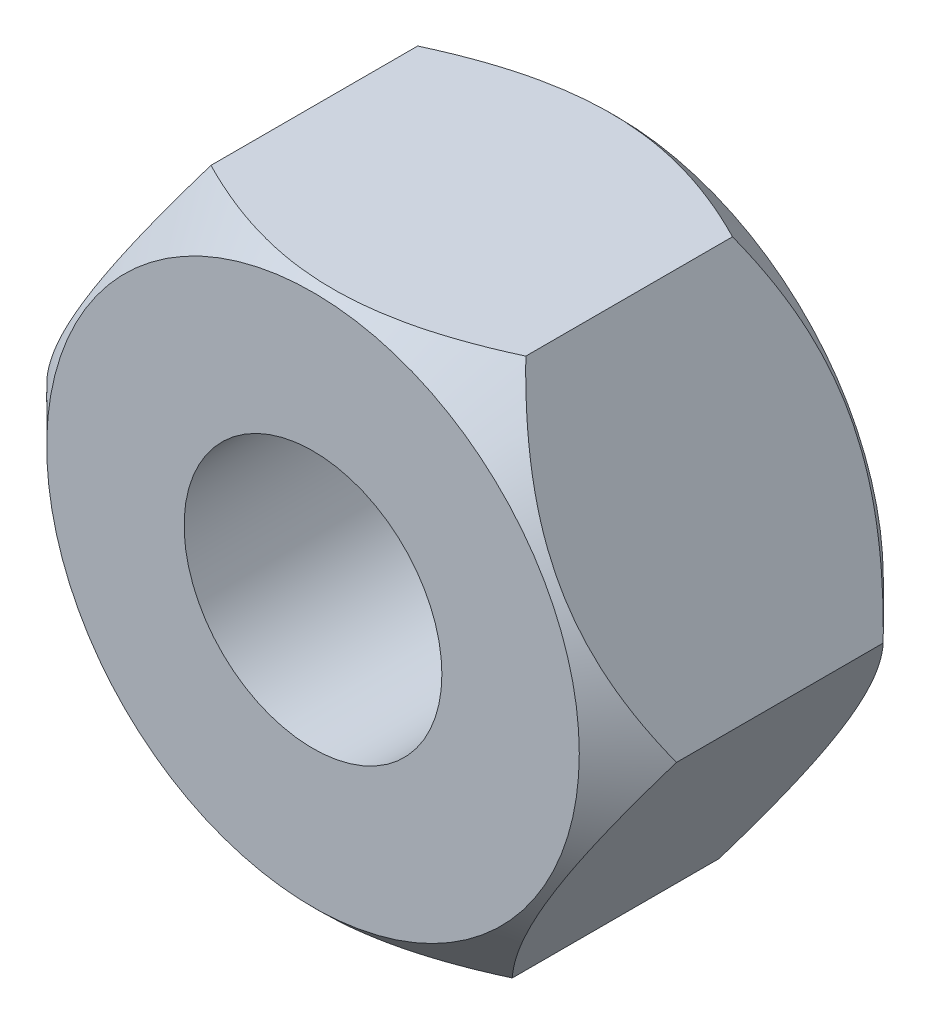
ISO-10303-21;
HEADER;
FILE_DESCRIPTION(('STEP AP214'),'2;1');
FILE_NAME('part.step','',(''),(''),'','','');
FILE_SCHEMA(('AUTOMOTIVE_DESIGN { 1 0 10303 214 1 1 1 1 }'));
ENDSEC;
DATA;
#1=APPLICATION_CONTEXT('core data for automotive mechanical design processes');
#2=APPLICATION_PROTOCOL_DEFINITION('international standard','automotive_design',2000,#1);
#3=PRODUCT_CONTEXT('',#1,'mechanical');
#4=PRODUCT('Part','Part','',(#3));
#5=PRODUCT_RELATED_PRODUCT_CATEGORY('part','',(#4));
#6=PRODUCT_DEFINITION_FORMATION('','',#4);
#7=PRODUCT_DEFINITION_CONTEXT('part definition',#1,'design');
#8=PRODUCT_DEFINITION('design','',#6,#7);
#9=PRODUCT_DEFINITION_SHAPE('','',#8);
#10=(LENGTH_UNIT() NAMED_UNIT(*) SI_UNIT(.MILLI.,.METRE.));
#11=(NAMED_UNIT(*) PLANE_ANGLE_UNIT() SI_UNIT($,.RADIAN.));
#12=(NAMED_UNIT(*) SI_UNIT($,.STERADIAN.) SOLID_ANGLE_UNIT());
#13=UNCERTAINTY_MEASURE_WITH_UNIT(LENGTH_MEASURE(1.E-05),#10,'distance_accuracy_value','');
#14=(GEOMETRIC_REPRESENTATION_CONTEXT(3) GLOBAL_UNCERTAINTY_ASSIGNED_CONTEXT((#13)) GLOBAL_UNIT_ASSIGNED_CONTEXT((#10,
#11,#12)) REPRESENTATION_CONTEXT('',''));
#15=CARTESIAN_POINT('',(0.,0.,0.));
#16=DIRECTION('',(0.,0.,1.));
#17=DIRECTION('',(1.,0.,0.));
#18=AXIS2_PLACEMENT_3D('',#15,#16,#17);
#19=CARTESIAN_POINT('',(0.,0.,0.599999999999999));
#20=DIRECTION('',(0.,0.,1.));
#21=DIRECTION('',(1.,0.,0.));
#22=AXIS2_PLACEMENT_3D('',#19,#20,#21);
#23=CONICAL_SURFACE('',#22,3.885,0.78539816339745);
#24=CARTESIAN_POINT('',(0.,0.,0.));
#25=DIRECTION('',(0.,0.,1.));
#26=DIRECTION('',(1.,0.,0.));
#27=AXIS2_PLACEMENT_3D('',#24,#25,#26);
#28=CIRCLE('',#27,3.285);
#29=CARTESIAN_POINT('',(3.285,0.,0.));
#30=VERTEX_POINT('',#29);
#31=EDGE_CURVE('E256',#30,#30,#28,.F.);
#32=ORIENTED_EDGE('',*,*,#31,.F.);
#33=EDGE_LOOP('',(#32));
#34=FACE_BOUND('',#33,.T.);
#35=CARTESIAN_POINT('',(-3.88393621874266,0.0957860703586579,0.600117182600256));
#36=CARTESIAN_POINT('',(-3.81432747230008,0.209753081961758,0.533403534923081));
#37=CARTESIAN_POINT('',(-3.74355478482969,0.32562575754246,0.470608192342962));
#38=CARTESIAN_POINT('',(-3.59924158049262,0.561902741020839,0.355631616504008));
#39=CARTESIAN_POINT('',(-3.52568734046069,0.682329517188863,0.303514352330282));
#40=CARTESIAN_POINT('',(-3.37736875756146,0.925164311982584,0.21423656712047));
#41=CARTESIAN_POINT('',(-3.3026421836569,1.04751049332441,0.176851660514754));
#42=CARTESIAN_POINT('',(-3.15154397343851,1.29489623659983,0.119252598754752));
#43=CARTESIAN_POINT('',(-3.07517695250471,1.4199282419964,0.0989954503753128));
#44=CARTESIAN_POINT('',(-2.94356112301121,1.6354164318234,0.080718082682288));
#45=CARTESIAN_POINT('',(-2.88848227797078,1.7255943432585,0.0780125494006204));
#46=CARTESIAN_POINT('',(-2.77841418286368,1.90580347664019,0.0825717961445522));
#47=CARTESIAN_POINT('',(-2.72342497097033,1.99583463608743,0.0898400713960599));
#48=CARTESIAN_POINT('',(-2.61396751308934,2.17504400286808,0.113931928536201));
#49=CARTESIAN_POINT('',(-2.55949991922261,2.26422114251567,0.130766198224998));
#50=CARTESIAN_POINT('',(-2.45150019324659,2.44104383581893,0.173071204872371));
#51=CARTESIAN_POINT('',(-2.39796798974781,2.52868950635715,0.198541279687599));
#52=CARTESIAN_POINT('',(-2.30293338267659,2.68428504169289,0.250944528651334));
#53=CARTESIAN_POINT('',(-2.2612206136008,2.75257932768724,0.276500136451541));
#54=CARTESIAN_POINT('',(-2.17854393261304,2.88794183230023,0.33173002019738));
#55=CARTESIAN_POINT('',(-2.13758004356713,2.95501001348138,0.361404421667987));
#56=CARTESIAN_POINT('',(-2.05653017850464,3.08770901158252,0.42420661778084));
#57=CARTESIAN_POINT('',(-2.01644189724197,3.15334360276971,0.457323553257847));
#58=CARTESIAN_POINT('',(-1.93700776123357,3.28339724635341,0.526575899032486));
#59=CARTESIAN_POINT('',(-1.89766146881812,3.34781701532526,0.56270945703257));
#60=CARTESIAN_POINT('',(-1.85865850009685,3.41167467712757,0.600117182600256));
#61=B_SPLINE_CURVE_WITH_KNOTS('',3,(#35,#36,#37,#38,#39,#40,#41,#42,#43,#44,#45,#46,#47,#48,#49,
#50,#51,#52,#53,#54,#55,#56,#57,#58,#59,#60),.UNSPECIFIED.,.F.,.F.,(4,2,2,2,2,2,2,2,2,2,2,2,4),
(0.,0.448150707406919,0.898912335595667,1.34251535645382,1.78500153365474,2.1016612602705,
2.41843198560602,2.73555732725301,3.05265835906844,3.30456080407632,3.55647092778736,
3.80760924167498,4.05859446750521),.UNSPECIFIED.);
#62=CARTESIAN_POINT('',(-3.88381406278636,0.0959860703586579,0.599999999999999));
#63=VERTEX_POINT('',#62);
#64=CARTESIAN_POINT('',(-1.85878065605314,3.41147467712757,0.599999999999999));
#65=VERTEX_POINT('',#64);
#66=EDGE_CURVE('E149',#63,#65,#61,.T.);
#67=ORIENTED_EDGE('',*,*,#66,.T.);
#68=CARTESIAN_POINT('',(-1.85898065605314,3.41147962000428,0.600100034398637));
#69=CARTESIAN_POINT('',(-1.72548002243513,3.40818023414176,0.533388295583328));
#70=CARTESIAN_POINT('',(-1.58974712034719,3.40482567914012,0.470594830359262));
#71=CARTESIAN_POINT('',(-1.3129730969512,3.39798537977108,0.355621835959947));
#72=CARTESIAN_POINT('',(-1.17190565820719,3.39449898498448,0.303506271380686));
#73=CARTESIAN_POINT('',(-0.887449983627508,3.38746883834185,0.214231478416903));
#74=CARTESIAN_POINT('',(-0.744134178883922,3.38392687657559,0.176847879293125));
#75=CARTESIAN_POINT('',(-0.454347655622486,3.37676498129402,0.119250908599851));
#76=CARTESIAN_POINT('',(-0.307885788030815,3.37314526652389,0.0989945473738914));
#77=CARTESIAN_POINT('',(-0.0554622919437957,3.36690677542625,0.0807178344892078));
#78=CARTESIAN_POINT('',(0.0501733937198126,3.3642960545749,0.0780124943011009));
#79=CARTESIAN_POINT('',(0.261272912154858,3.35907886011048,0.0825721053586667));
#80=CARTESIAN_POINT('',(0.366736671709077,3.35647238830694,0.0898405517431846));
#81=CARTESIAN_POINT('',(0.576665010368219,3.3512841388287,0.11393271862506));
#82=CARTESIAN_POINT('',(0.681128338833483,3.3487023920628,0.130767126227319));
#83=CARTESIAN_POINT('',(0.888260867781066,3.34358323929809,0.173072372500431));
#84=CARTESIAN_POINT('',(0.990930205187871,3.34104582991528,0.198542549000921));
#85=CARTESIAN_POINT('',(1.17319356216092,3.33654130340516,0.250944977705818));
#86=CARTESIAN_POINT('',(1.25319109996945,3.33456421357323,0.276499472781657));
#87=CARTESIAN_POINT('',(1.41175006327297,3.33064552653992,0.331726790229512));
#88=CARTESIAN_POINT('',(1.49031144498599,3.32870393042057,0.361399737918555));
#89=CARTESIAN_POINT('',(1.64575058409665,3.32486234791895,0.424198760056415));
#90=CARTESIAN_POINT('',(1.72263276247261,3.32296225227492,0.457313975869242));
#91=CARTESIAN_POINT('',(1.87497334035334,3.31919724880396,0.526562676771717));
#92=CARTESIAN_POINT('',(1.95043257903981,3.31733232023717,0.562694310040499));
#93=CARTESIAN_POINT('',(2.02523340673322,3.3154836638922,0.600100034398637));
#94=B_SPLINE_CURVE_WITH_KNOTS('',3,(#68,#69,#70,#71,#72,#73,#74,#75,#76,#77,#78,#79,#80,#81,#82,
#83,#84,#85,#86,#87,#88,#89,#90,#91,#92,#93),.UNSPECIFIED.,.F.,.F.,(4,2,2,2,2,2,2,2,2,2,2,2,4),
(0.,0.448142581482843,0.898895901479806,1.3424910441838,1.78496942204691,2.10162883673493,
2.41839924751297,2.73552425237839,3.05262494634458,3.30451657794585,3.5564158758327,
3.80754337623053,4.05851782396052),.UNSPECIFIED.);
#95=CARTESIAN_POINT('',(2.02503340673322,3.31548860676891,0.599999999999999));
#96=VERTEX_POINT('',#95);
#97=EDGE_CURVE('E133',#65,#96,#94,.T.);
#98=ORIENTED_EDGE('',*,*,#97,.T.);
#99=CARTESIAN_POINT('',(2.02492443446568,3.31568860676891,0.600113885377533));
#100=CARTESIAN_POINT('',(2.08881819828606,3.19842250730216,0.53340060473433));
#101=CARTESIAN_POINT('',(2.15378033990459,3.07919558271485,0.470605623130255));
#102=CARTESIAN_POINT('',(2.28624519836053,2.83607894129721,0.355629735926545));
#103=CARTESIAN_POINT('',(2.35376051150211,2.71216610610024,0.303512798548834));
#104=CARTESIAN_POINT('',(2.48990188708813,2.46230184491991,0.214235588683634));
#105=CARTESIAN_POINT('',(2.55849328191177,2.33641404543818,0.176850933478149));
#106=CARTESIAN_POINT('',(2.6971860622483,2.08186711625766,0.119252273783184));
#107=CARTESIAN_POINT('',(2.76728321138255,1.95321576170888,0.0989952767547544));
#108=CARTESIAN_POINT('',(2.88809329797167,1.73148946506476,0.0807180349625505));
#109=CARTESIAN_POINT('',(2.9386502285016,1.63870084705624,0.0780125388061672));
#110=CARTESIAN_POINT('',(3.03968184851493,1.45327455044493,0.0825718555946414));
#111=CARTESIAN_POINT('',(3.09015650295858,1.36063693615164,0.0898401637486656));
#112=CARTESIAN_POINT('',(3.19062761482422,1.17623935658986,0.113932080440056));
#113=CARTESIAN_POINT('',(3.24062347366949,1.08448048990676,0.130766376643903));
#114=CARTESIAN_POINT('',(3.33975652942678,0.902538683980961,0.17307142936074));
#115=CARTESIAN_POINT('',(3.38889379186789,0.812355624470771,0.198541523725189));
#116=CARTESIAN_POINT('',(3.47612584034231,0.652256086402455,0.250944614970376));
#117=CARTESIAN_POINT('',(3.51441372646593,0.581985205582748,0.276500008819832));
#118=CARTESIAN_POINT('',(3.59030213300601,0.44270498639391,0.331729399126499));
#119=CARTESIAN_POINT('',(3.6279026324404,0.373695686533798,0.361403521068699));
#120=CARTESIAN_POINT('',(3.70229780546919,0.23715604262167,0.424205106899933));
#121=CARTESIAN_POINT('',(3.73909459502827,0.169621815077606,0.457321711725485));
#122=CARTESIAN_POINT('',(3.81200671114683,0.0358040690276733,0.526573356676187));
#123=CARTESIAN_POINT('',(3.84812243942313,-0.0304801867608648,0.562706544595449));
#124=CARTESIAN_POINT('',(3.8839230350539,-0.0961860703586588,0.600113885377532));
#125=B_SPLINE_CURVE_WITH_KNOTS('',3,(#99,#100,#101,#102,#103,#104,#105,#106,#107,#108,#109,#110,
#111,#112,#113,#114,#115,#116,#117,#118,#119,#120,#121,#122,#123,#124),.UNSPECIFIED.,.F.,.F.,(4,
2,2,2,2,2,2,2,2,2,2,2,4),(0.,0.448149144958839,0.898909175652596,1.34251068170457,
1.78499535925434,2.10165502588874,2.41842569073722,2.73555096762401,3.05265193447399,
3.30455230033247,3.55646034250635,3.80759657722808,4.05857973069729),.UNSPECIFIED.);
#126=CARTESIAN_POINT('',(3.88381406278636,-0.0959860703586585,0.599999999999999));
#127=VERTEX_POINT('',#126);
#128=EDGE_CURVE('E199',#96,#127,#125,.T.);
#129=ORIENTED_EDGE('',*,*,#128,.T.);
#130=CARTESIAN_POINT('',(3.88393621874266,-0.0957860703586585,0.600117182600255));
#131=CARTESIAN_POINT('',(3.81432747230008,-0.209753081961759,0.53340353492308));
#132=CARTESIAN_POINT('',(3.74355478482969,-0.325625757542461,0.470608192342961));
#133=CARTESIAN_POINT('',(3.59924158049262,-0.561902741020839,0.355631616504008));
#134=CARTESIAN_POINT('',(3.52568734046069,-0.682329517188863,0.303514352330281));
#135=CARTESIAN_POINT('',(3.37736875756146,-0.925164311982584,0.214236567120469));
#136=CARTESIAN_POINT('',(3.3026421836569,-1.04751049332441,0.176851660514753));
#137=CARTESIAN_POINT('',(3.15154397343851,-1.29489623659983,0.11925259875475));
#138=CARTESIAN_POINT('',(3.07517695250471,-1.4199282419964,0.0989954503753113));
#139=CARTESIAN_POINT('',(2.94356112301121,-1.6354164318234,0.0807180826822865));
#140=CARTESIAN_POINT('',(2.88848227797078,-1.7255943432585,0.0780125494006191));
#141=CARTESIAN_POINT('',(2.77841418286368,-1.90580347664019,0.082571796144551));
#142=CARTESIAN_POINT('',(2.72342497097033,-1.99583463608743,0.0898400713960587));
#143=CARTESIAN_POINT('',(2.61396751308934,-2.17504400286808,0.1139319285362));
#144=CARTESIAN_POINT('',(2.55949991922261,-2.26422114251566,0.130766198224996));
#145=CARTESIAN_POINT('',(2.45150019324659,-2.44104383581893,0.173071204872368));
#146=CARTESIAN_POINT('',(2.39796798974781,-2.52868950635715,0.198541279687597));
#147=CARTESIAN_POINT('',(2.30293338267659,-2.68428504169289,0.250944528651332));
#148=CARTESIAN_POINT('',(2.2612206136008,-2.75257932768724,0.27650013645154));
#149=CARTESIAN_POINT('',(2.17854393261304,-2.88794183230023,0.331730020197378));
#150=CARTESIAN_POINT('',(2.13758004356713,-2.95501001348138,0.361404421667986));
#151=CARTESIAN_POINT('',(2.05653017850464,-3.08770901158252,0.424206617780838));
#152=CARTESIAN_POINT('',(2.01644189724197,-3.15334360276971,0.457323553257846));
#153=CARTESIAN_POINT('',(1.93700776123357,-3.28339724635341,0.526575899032485));
#154=CARTESIAN_POINT('',(1.89766146881812,-3.34781701532526,0.562709457032569));
#155=CARTESIAN_POINT('',(1.85865850009684,-3.41167467712757,0.600117182600256));
#156=B_SPLINE_CURVE_WITH_KNOTS('',3,(#130,#131,#132,#133,#134,#135,#136,#137,#138,#139,#140,
#141,#142,#143,#144,#145,#146,#147,#148,#149,#150,#151,#152,#153,#154,#155),.UNSPECIFIED.,.F.,
.F.,(4,2,2,2,2,2,2,2,2,2,2,2,4),(0.,0.448150707406919,0.898912335595666,1.34251535645382,
1.78500153365474,2.1016612602705,2.41843198560602,2.73555732725301,3.05265835906844,
3.30456080407632,3.55647092778736,3.80760924167498,4.05859446750521),.UNSPECIFIED.);
#157=CARTESIAN_POINT('',(1.85878065605314,-3.41147467712757,0.599999999999999));
#158=VERTEX_POINT('',#157);
#159=EDGE_CURVE('E89',#127,#158,#156,.T.);
#160=ORIENTED_EDGE('',*,*,#159,.T.);
#161=CARTESIAN_POINT('',(1.85898065605314,-3.41147962000428,0.600100034398637));
#162=CARTESIAN_POINT('',(1.72548002243513,-3.40818023414177,0.533388295583328));
#163=CARTESIAN_POINT('',(1.58974712034719,-3.40482567914012,0.470594830359262));
#164=CARTESIAN_POINT('',(1.3129730969512,-3.39798537977108,0.355621835959948));
#165=CARTESIAN_POINT('',(1.17190565820719,-3.39449898498449,0.303506271380688));
#166=CARTESIAN_POINT('',(0.887449983627508,-3.38746883834185,0.214231478416905));
#167=CARTESIAN_POINT('',(0.744134178883922,-3.3839268765756,0.176847879293127));
#168=CARTESIAN_POINT('',(0.454347655622486,-3.37676498129403,0.119250908599852));
#169=CARTESIAN_POINT('',(0.307885788030814,-3.37314526652389,0.0989945473738929));
#170=CARTESIAN_POINT('',(0.0554622919437948,-3.36690677542625,0.0807178344892098));
#171=CARTESIAN_POINT('',(-0.0501733937198136,-3.3642960545749,0.078012494301103));
#172=CARTESIAN_POINT('',(-0.261272912154859,-3.35907886011048,0.0825721053586687));
#173=CARTESIAN_POINT('',(-0.366736671709079,-3.35647238830694,0.0898405517431862));
#174=CARTESIAN_POINT('',(-0.576665010368221,-3.35128413882871,0.113932718625061));
#175=CARTESIAN_POINT('',(-0.681128338833485,-3.3487023920628,0.130767126227321));
#176=CARTESIAN_POINT('',(-0.888260867781068,-3.34358323929809,0.173072372500433));
#177=CARTESIAN_POINT('',(-0.990930205187872,-3.34104582991528,0.198542549000923));
#178=CARTESIAN_POINT('',(-1.17319356216092,-3.33654130340516,0.25094497770582));
#179=CARTESIAN_POINT('',(-1.25319109996945,-3.33456421357324,0.276499472781659));
#180=CARTESIAN_POINT('',(-1.41175006327297,-3.33064552653992,0.331726790229513));
#181=CARTESIAN_POINT('',(-1.49031144498599,-3.32870393042057,0.361399737918556));
#182=CARTESIAN_POINT('',(-1.64575058409665,-3.32486234791895,0.424198760056416));
#183=CARTESIAN_POINT('',(-1.72263276247261,-3.32296225227492,0.457313975869243));
#184=CARTESIAN_POINT('',(-1.87497334035334,-3.31919724880396,0.526562676771718));
#185=CARTESIAN_POINT('',(-1.95043257903981,-3.31733232023718,0.5626943100405));
#186=CARTESIAN_POINT('',(-2.02523340673322,-3.3154836638922,0.600100034398638));
#187=B_SPLINE_CURVE_WITH_KNOTS('',3,(#161,#162,#163,#164,#165,#166,#167,#168,#169,#170,#171,
#172,#173,#174,#175,#176,#177,#178,#179,#180,#181,#182,#183,#184,#185,#186),.UNSPECIFIED.,.F.,
.F.,(4,2,2,2,2,2,2,2,2,2,2,2,4),(0.,0.448142581482842,0.898895901479803,1.3424910441838,
1.78496942204691,2.10162883673493,2.41839924751296,2.73552425237839,3.05262494634457,
3.30451657794585,3.55641587583269,3.80754337623052,4.05851782396052),.UNSPECIFIED.);
#188=CARTESIAN_POINT('',(-2.02503340673322,-3.31548860676891,0.599999999999999));
#189=VERTEX_POINT('',#188);
#190=EDGE_CURVE('E97',#158,#189,#187,.T.);
#191=ORIENTED_EDGE('',*,*,#190,.T.);
#192=CARTESIAN_POINT('',(-2.02492443446568,-3.31568860676891,0.600113885377534));
#193=CARTESIAN_POINT('',(-2.08881819828606,-3.19842250730216,0.533400604734331));
#194=CARTESIAN_POINT('',(-2.15378033990459,-3.07919558271485,0.470605623130256));
#195=CARTESIAN_POINT('',(-2.28624519836053,-2.83607894129721,0.355629735926545));
#196=CARTESIAN_POINT('',(-2.35376051150211,-2.71216610610024,0.303512798548835));
#197=CARTESIAN_POINT('',(-2.48990188708813,-2.46230184491991,0.214235588683634));
#198=CARTESIAN_POINT('',(-2.55849328191177,-2.33641404543818,0.17685093347815));
#199=CARTESIAN_POINT('',(-2.6971860622483,-2.08186711625766,0.119252273783185));
#200=CARTESIAN_POINT('',(-2.76728321138255,-1.95321576170887,0.0989952767547553));
#201=CARTESIAN_POINT('',(-2.88809329797167,-1.73148946506476,0.0807180349625512));
#202=CARTESIAN_POINT('',(-2.9386502285016,-1.63870084705624,0.0780125388061677));
#203=CARTESIAN_POINT('',(-3.03968184851494,-1.45327455044493,0.0825718555946419));
#204=CARTESIAN_POINT('',(-3.09015650295859,-1.36063693615164,0.0898401637486667));
#205=CARTESIAN_POINT('',(-3.19062761482422,-1.17623935658985,0.113932080440057));
#206=CARTESIAN_POINT('',(-3.24062347366949,-1.08448048990676,0.130766376643904));
#207=CARTESIAN_POINT('',(-3.33975652942678,-0.902538683980958,0.173071429360741));
#208=CARTESIAN_POINT('',(-3.38889379186789,-0.812355624470769,0.19854152372519));
#209=CARTESIAN_POINT('',(-3.47612584034231,-0.652256086402453,0.250944614970378));
#210=CARTESIAN_POINT('',(-3.51441372646593,-0.581985205582745,0.276500008819833));
#211=CARTESIAN_POINT('',(-3.59030213300601,-0.442704986393908,0.3317293991265));
#212=CARTESIAN_POINT('',(-3.6279026324404,-0.373695686533797,0.3614035210687));
#213=CARTESIAN_POINT('',(-3.70229780546919,-0.23715604262167,0.424205106899935));
#214=CARTESIAN_POINT('',(-3.73909459502827,-0.169621815077605,0.457321711725487));
#215=CARTESIAN_POINT('',(-3.81200671114683,-0.0358040690276734,0.526573356676188));
#216=CARTESIAN_POINT('',(-3.84812243942313,0.0304801867608646,0.56270654459545));
#217=CARTESIAN_POINT('',(-3.8839230350539,0.0961860703586582,0.600113885377532));
#218=B_SPLINE_CURVE_WITH_KNOTS('',3,(#192,#193,#194,#195,#196,#197,#198,#199,#200,#201,#202,
#203,#204,#205,#206,#207,#208,#209,#210,#211,#212,#213,#214,#215,#216,#217),.UNSPECIFIED.,.F.,
.F.,(4,2,2,2,2,2,2,2,2,2,2,2,4),(0.,0.448149144958841,0.898909175652598,1.34251068170457,
1.78499535925434,2.10165502588874,2.41842569073722,2.73555096762401,3.052651934474,
3.30455230033247,3.55646034250635,3.80759657722808,4.05857973069729),.UNSPECIFIED.);
#219=EDGE_CURVE('E182',#189,#63,#218,.T.);
#220=ORIENTED_EDGE('',*,*,#219,.T.);
#221=EDGE_LOOP('',(#67,#98,#129,#160,#191,#220));
#222=FACE_BOUND('',#221,.T.);
#223=ADVANCED_FACE('F69',(#34,#222),#23,.T.);
#224=CARTESIAN_POINT('',(0.,0.,3.75));
#225=DIRECTION('',(0.,0.,-1.));
#226=DIRECTION('',(-1.,0.,0.));
#227=AXIS2_PLACEMENT_3D('',#224,#225,#226);
#228=CONICAL_SURFACE('',#227,3.285,0.785398163397446);
#229=CARTESIAN_POINT('',(0.,0.,3.75));
#230=DIRECTION('',(0.,0.,1.));
#231=DIRECTION('',(1.,0.,0.));
#232=AXIS2_PLACEMENT_3D('',#229,#230,#231);
#233=CIRCLE('',#232,3.285);
#234=CARTESIAN_POINT('',(3.285,0.,3.75));
#235=VERTEX_POINT('',#234);
#236=EDGE_CURVE('E82',#235,#235,#233,.T.);
#237=ORIENTED_EDGE('',*,*,#236,.F.);
#238=EDGE_LOOP('',(#237));
#239=FACE_BOUND('',#238,.T.);
#240=CARTESIAN_POINT('',(3.8839230350539,-0.0961860703586585,3.14988611462246));
#241=CARTESIAN_POINT('',(3.82002927123352,0.0210800291080921,3.21659939526567));
#242=CARTESIAN_POINT('',(3.75506712961498,0.140306953695399,3.27939437686974));
#243=CARTESIAN_POINT('',(3.62260227115905,0.383423595113035,3.39437026407345));
#244=CARTESIAN_POINT('',(3.55508695801747,0.507336430310006,3.44648720145116));
#245=CARTESIAN_POINT('',(3.41894558243146,0.757200691490337,3.53576441131636));
#246=CARTESIAN_POINT('',(3.35035418760781,0.883088490972062,3.57314906652185));
#247=CARTESIAN_POINT('',(3.21166140727128,1.13763542015258,3.63074772621682));
#248=CARTESIAN_POINT('',(3.14156425813704,1.26628677470137,3.65100472324525));
#249=CARTESIAN_POINT('',(3.02075417154791,1.48801307134548,3.66928196503745));
#250=CARTESIAN_POINT('',(2.97019724101799,1.580801689354,3.67198746119383));
#251=CARTESIAN_POINT('',(2.86916562100465,1.76622798596531,3.66742814440536));
#252=CARTESIAN_POINT('',(2.818690966561,1.8588656002586,3.66015983625134));
#253=CARTESIAN_POINT('',(2.71821985469537,2.04326317982038,3.63606791955995));
#254=CARTESIAN_POINT('',(2.6682239958501,2.13502204650347,3.6192336233561));
#255=CARTESIAN_POINT('',(2.56909094009281,2.31696385242927,3.57692857063927));
#256=CARTESIAN_POINT('',(2.5199536776517,2.40714691193946,3.55145847627482));
#257=CARTESIAN_POINT('',(2.43272162917728,2.56724645000777,3.49905538502963));
#258=CARTESIAN_POINT('',(2.39443374305366,2.63751733082748,3.47349999118018));
#259=CARTESIAN_POINT('',(2.31854533651357,2.77679755001633,3.41827060087351));
#260=CARTESIAN_POINT('',(2.28094483707919,2.84580684987644,3.38859647893131));
#261=CARTESIAN_POINT('',(2.2065496640504,2.98234649378857,3.32579489310007));
#262=CARTESIAN_POINT('',(2.16975287449131,3.04988072133264,3.29267828827452));
#263=CARTESIAN_POINT('',(2.09684075837275,3.18369846738258,3.22342664332381));
#264=CARTESIAN_POINT('',(2.06072503009645,3.24998272317111,3.18729345540455));
#265=CARTESIAN_POINT('',(2.02492443446568,3.31568860676891,3.14988611462246));
#266=B_SPLINE_CURVE_WITH_KNOTS('',3,(#240,#241,#242,#243,#244,#245,#246,#247,#248,#249,#250,
#251,#252,#253,#254,#255,#256,#257,#258,#259,#260,#261,#262,#263,#264,#265),.UNSPECIFIED.,.F.,
.F.,(4,2,2,2,2,2,2,2,2,2,2,2,4),(0.,0.448149144958837,0.89890917565259,1.34251068170456,
1.78499535925433,2.10165502588872,2.4184256907372,2.73555096762399,3.05265193447396,
3.30455230033245,3.55646034250634,3.80759657722807,4.0585797306973),.UNSPECIFIED.);
#267=CARTESIAN_POINT('',(3.88381406278636,-0.0959860703586585,3.15));
#268=VERTEX_POINT('',#267);
#269=CARTESIAN_POINT('',(2.02503340673322,3.31548860676891,3.15));
#270=VERTEX_POINT('',#269);
#271=EDGE_CURVE('E12',#268,#270,#266,.T.);
#272=ORIENTED_EDGE('',*,*,#271,.T.);
#273=CARTESIAN_POINT('',(2.02523340673322,3.3154836638922,3.14989996560136));
#274=CARTESIAN_POINT('',(1.8917327731152,3.31878304975471,3.21661170441667));
#275=CARTESIAN_POINT('',(1.75599987102727,3.32213760475636,3.27940516964074));
#276=CARTESIAN_POINT('',(1.47922584763128,3.3289779041254,3.39437816404005));
#277=CARTESIAN_POINT('',(1.33815840888727,3.332464298912,3.44649372861931));
#278=CARTESIAN_POINT('',(1.05370273430759,3.33949444555463,3.5357685215831));
#279=CARTESIAN_POINT('',(0.910386929564007,3.34303640732089,3.57315212070687));
#280=CARTESIAN_POINT('',(0.620600406302573,3.35019830260245,3.63074909140015));
#281=CARTESIAN_POINT('',(0.474138538710902,3.35381801737259,3.65100545262611));
#282=CARTESIAN_POINT('',(0.221715042623886,3.36005650847023,3.66928216551079));
#283=CARTESIAN_POINT('',(0.116079356960279,3.36266722932158,3.6719875056989));
#284=CARTESIAN_POINT('',(-0.0950201614747634,3.367884423786,3.66742789464134));
#285=CARTESIAN_POINT('',(-0.200483921028981,3.37049089558954,3.66015944825682));
#286=CARTESIAN_POINT('',(-0.41041225968812,3.37567914506777,3.63606728137495));
#287=CARTESIAN_POINT('',(-0.514875588153384,3.37826089183368,3.61923287377269));
#288=CARTESIAN_POINT('',(-0.722008117100964,3.38338004459839,3.57692762749957));
#289=CARTESIAN_POINT('',(-0.824677454507768,3.3859174539812,3.55145745099909));
#290=CARTESIAN_POINT('',(-1.00694081148081,3.39042198049132,3.49905502229419));
#291=CARTESIAN_POINT('',(-1.08693834928935,3.39239907032324,3.47350052721835));
#292=CARTESIAN_POINT('',(-1.24549731259288,3.39631775735656,3.41827320977049));
#293=CARTESIAN_POINT('',(-1.3240586943059,3.39825935347591,3.38860026208145));
#294=CARTESIAN_POINT('',(-1.47949783341657,3.40210093597753,3.32580123994359));
#295=CARTESIAN_POINT('',(-1.55638001179252,3.40400103162156,3.29268602413076));
#296=CARTESIAN_POINT('',(-1.70872058967326,3.40776603509252,3.22343732322828));
#297=CARTESIAN_POINT('',(-1.78417982835973,3.4096309636593,3.1873056899595));
#298=CARTESIAN_POINT('',(-1.85898065605314,3.41147962000428,3.14989996560136));
#299=B_SPLINE_CURVE_WITH_KNOTS('',3,(#273,#274,#275,#276,#277,#278,#279,#280,#281,#282,#283,
#284,#285,#286,#287,#288,#289,#290,#291,#292,#293,#294,#295,#296,#297,#298),.UNSPECIFIED.,.F.,
.F.,(4,2,2,2,2,2,2,2,2,2,2,2,4),(0.,0.448142581482841,0.8988959014798,1.34249104418379,
1.7849694220469,2.10162883673492,2.41839924751295,2.73552425237837,3.05262494634455,
3.30451657794583,3.55641587583268,3.80754337623052,4.05851782396052),.UNSPECIFIED.);
#300=CARTESIAN_POINT('',(-1.85878065605314,3.41147467712757,3.15));
#301=VERTEX_POINT('',#300);
#302=EDGE_CURVE('E130',#270,#301,#299,.T.);
#303=ORIENTED_EDGE('',*,*,#302,.T.);
#304=CARTESIAN_POINT('',(-1.85865850009685,3.41167467712757,3.14988281739974));
#305=CARTESIAN_POINT('',(-1.92826724653942,3.29770766552447,3.21659646507692));
#306=CARTESIAN_POINT('',(-1.99903993400981,3.18183498994377,3.27939180765703));
#307=CARTESIAN_POINT('',(-2.14335313834688,2.94555800646539,3.39436838349599));
#308=CARTESIAN_POINT('',(-2.21690737837881,2.82513123029737,3.44648564766972));
#309=CARTESIAN_POINT('',(-2.36522596127804,2.58229643550365,3.53576343287953));
#310=CARTESIAN_POINT('',(-2.43995253518259,2.45995025416183,3.57314833948524));
#311=CARTESIAN_POINT('',(-2.59105074540099,2.21256451088641,3.63074740124525));
#312=CARTESIAN_POINT('',(-2.66741776633479,2.08753250548984,3.65100454962469));
#313=CARTESIAN_POINT('',(-2.79903359582829,1.87204431566284,3.66928191731771));
#314=CARTESIAN_POINT('',(-2.85411244086871,1.78186640422774,3.67198745059938));
#315=CARTESIAN_POINT('',(-2.96418053597581,1.60165727084606,3.66742820385545));
#316=CARTESIAN_POINT('',(-3.01916974786916,1.51162611139881,3.66015992860394));
#317=CARTESIAN_POINT('',(-3.12862720575015,1.33241674461816,3.6360680714638));
#318=CARTESIAN_POINT('',(-3.18309479961688,1.24323960497058,3.61923380177501));
#319=CARTESIAN_POINT('',(-3.2910945255929,1.06641691166732,3.57692879512764));
#320=CARTESIAN_POINT('',(-3.34462672909168,0.9787712411291,3.55145872031241));
#321=CARTESIAN_POINT('',(-3.4396613361629,0.823175705793363,3.49905547134867));
#322=CARTESIAN_POINT('',(-3.48137410523869,0.754881419799006,3.47349986354847));
#323=CARTESIAN_POINT('',(-3.56405078622645,0.619518915186016,3.41826997980263));
#324=CARTESIAN_POINT('',(-3.60501467527236,0.552450734004864,3.38859557833202));
#325=CARTESIAN_POINT('',(-3.68606454033485,0.419751735903721,3.32579338221916));
#326=CARTESIAN_POINT('',(-3.72615282159753,0.354117144716524,3.29267644674216));
#327=CARTESIAN_POINT('',(-3.80558695760593,0.224063501132821,3.22342410096751));
#328=CARTESIAN_POINT('',(-3.84493325002138,0.15964373216097,3.18729054296743));
#329=CARTESIAN_POINT('',(-3.88393621874266,0.0957860703586576,3.14988281739974));
#330=B_SPLINE_CURVE_WITH_KNOTS('',3,(#304,#305,#306,#307,#308,#309,#310,#311,#312,#313,#314,
#315,#316,#317,#318,#319,#320,#321,#322,#323,#324,#325,#326,#327,#328,#329),.UNSPECIFIED.,.F.,
.F.,(4,2,2,2,2,2,2,2,2,2,2,2,4),(0.,0.448150707406916,0.89891233559566,1.34251535645381,
1.78500153365473,2.10166126027049,2.418431985606,2.73555732725299,3.05265835906842,
3.3045608040763,3.55647092778734,3.80760924167498,4.05859446750522),.UNSPECIFIED.);
#331=CARTESIAN_POINT('',(-3.88381406278636,0.0959860703586579,3.15));
#332=VERTEX_POINT('',#331);
#333=EDGE_CURVE('E137',#301,#332,#330,.T.);
#334=ORIENTED_EDGE('',*,*,#333,.T.);
#335=CARTESIAN_POINT('',(-3.8839230350539,0.0961860703586579,3.14988611462246));
#336=CARTESIAN_POINT('',(-3.82002927123352,-0.0210800291080929,3.21659939526567));
#337=CARTESIAN_POINT('',(-3.75506712961499,-0.1403069536954,3.27939437686974));
#338=CARTESIAN_POINT('',(-3.62260227115905,-0.383423595113036,3.39437026407345));
#339=CARTESIAN_POINT('',(-3.55508695801747,-0.507336430310007,3.44648720145116));
#340=CARTESIAN_POINT('',(-3.41894558243146,-0.757200691490338,3.53576441131636));
#341=CARTESIAN_POINT('',(-3.35035418760781,-0.883088490972062,3.57314906652185));
#342=CARTESIAN_POINT('',(-3.21166140727128,-1.13763542015258,3.63074772621681));
#343=CARTESIAN_POINT('',(-3.14156425813704,-1.26628677470137,3.65100472324525));
#344=CARTESIAN_POINT('',(-3.02075417154792,-1.48801307134548,3.66928196503745));
#345=CARTESIAN_POINT('',(-2.97019724101799,-1.580801689354,3.67198746119383));
#346=CARTESIAN_POINT('',(-2.86916562100465,-1.76622798596531,3.66742814440536));
#347=CARTESIAN_POINT('',(-2.818690966561,-1.8588656002586,3.66015983625134));
#348=CARTESIAN_POINT('',(-2.71821985469537,-2.04326317982038,3.63606791955995));
#349=CARTESIAN_POINT('',(-2.6682239958501,-2.13502204650347,3.6192336233561));
#350=CARTESIAN_POINT('',(-2.56909094009281,-2.31696385242927,3.57692857063927));
#351=CARTESIAN_POINT('',(-2.5199536776517,-2.40714691193946,3.55145847627482));
#352=CARTESIAN_POINT('',(-2.43272162917728,-2.56724645000778,3.49905538502963));
#353=CARTESIAN_POINT('',(-2.39443374305366,-2.63751733082749,3.47349999118017));
#354=CARTESIAN_POINT('',(-2.31854533651357,-2.77679755001633,3.41827060087351));
#355=CARTESIAN_POINT('',(-2.28094483707919,-2.84580684987644,3.3885964789313));
#356=CARTESIAN_POINT('',(-2.2065496640504,-2.98234649378857,3.32579489310007));
#357=CARTESIAN_POINT('',(-2.16975287449131,-3.04988072133264,3.29267828827451));
#358=CARTESIAN_POINT('',(-2.09684075837275,-3.18369846738258,3.22342664332381));
#359=CARTESIAN_POINT('',(-2.06072503009645,-3.24998272317112,3.18729345540455));
#360=CARTESIAN_POINT('',(-2.02492443446568,-3.31568860676891,3.14988611462246));
#361=B_SPLINE_CURVE_WITH_KNOTS('',3,(#335,#336,#337,#338,#339,#340,#341,#342,#343,#344,#345,
#346,#347,#348,#349,#350,#351,#352,#353,#354,#355,#356,#357,#358,#359,#360),.UNSPECIFIED.,.F.,
.F.,(4,2,2,2,2,2,2,2,2,2,2,2,4),(0.,0.448149144958837,0.89890917565259,1.34251068170456,
1.78499535925433,2.10165502588872,2.4184256907372,2.73555096762398,3.05265193447396,
3.30455230033245,3.55646034250634,3.80759657722807,4.0585797306973),.UNSPECIFIED.);
#362=CARTESIAN_POINT('',(-2.02503340673322,-3.31548860676891,3.15));
#363=VERTEX_POINT('',#362);
#364=EDGE_CURVE('E177',#332,#363,#361,.T.);
#365=ORIENTED_EDGE('',*,*,#364,.T.);
#366=CARTESIAN_POINT('',(-2.02523340673322,-3.3154836638922,3.14989996560136));
#367=CARTESIAN_POINT('',(-1.89173277311521,-3.31878304975472,3.21661170441667));
#368=CARTESIAN_POINT('',(-1.75599987102727,-3.32213760475637,3.27940516964073));
#369=CARTESIAN_POINT('',(-1.47922584763128,-3.3289779041254,3.39437816404005));
#370=CARTESIAN_POINT('',(-1.33815840888727,-3.332464298912,3.44649372861931));
#371=CARTESIAN_POINT('',(-1.05370273430759,-3.33949444555463,3.53576852158309));
#372=CARTESIAN_POINT('',(-0.910386929564008,-3.34303640732089,3.57315212070687));
#373=CARTESIAN_POINT('',(-0.620600406302573,-3.35019830260246,3.63074909140015));
#374=CARTESIAN_POINT('',(-0.474138538710902,-3.35381801737259,3.65100545262611));
#375=CARTESIAN_POINT('',(-0.221715042623885,-3.36005650847023,3.66928216551079));
#376=CARTESIAN_POINT('',(-0.116079356960278,-3.36266722932158,3.6719875056989));
#377=CARTESIAN_POINT('',(0.0950201614747649,-3.367884423786,3.66742789464133));
#378=CARTESIAN_POINT('',(0.200483921028983,-3.37049089558954,3.66015944825682));
#379=CARTESIAN_POINT('',(0.410412259688122,-3.37567914506778,3.63606728137494));
#380=CARTESIAN_POINT('',(0.514875588153385,-3.37826089183368,3.61923287377268));
#381=CARTESIAN_POINT('',(0.722008117100966,-3.38338004459839,3.57692762749957));
#382=CARTESIAN_POINT('',(0.824677454507769,-3.3859174539812,3.55145745099908));
#383=CARTESIAN_POINT('',(1.00694081148082,-3.39042198049132,3.49905502229419));
#384=CARTESIAN_POINT('',(1.08693834928935,-3.39239907032325,3.47350052721835));
#385=CARTESIAN_POINT('',(1.24549731259288,-3.39631775735656,3.41827320977049));
#386=CARTESIAN_POINT('',(1.3240586943059,-3.39825935347591,3.38860026208145));
#387=CARTESIAN_POINT('',(1.47949783341656,-3.40210093597754,3.32580123994359));
#388=CARTESIAN_POINT('',(1.55638001179252,-3.40400103162156,3.29268602413076));
#389=CARTESIAN_POINT('',(1.70872058967326,-3.40776603509252,3.22343732322828));
#390=CARTESIAN_POINT('',(1.78417982835973,-3.40963096365931,3.1873056899595));
#391=CARTESIAN_POINT('',(1.85898065605314,-3.41147962000428,3.14989996560136));
#392=B_SPLINE_CURVE_WITH_KNOTS('',3,(#366,#367,#368,#369,#370,#371,#372,#373,#374,#375,#376,
#377,#378,#379,#380,#381,#382,#383,#384,#385,#386,#387,#388,#389,#390,#391),.UNSPECIFIED.,.F.,
.F.,(4,2,2,2,2,2,2,2,2,2,2,2,4),(0.,0.44814258148284,0.898895901479799,1.34249104418379,
1.7849694220469,2.10162883673492,2.41839924751295,2.73552425237837,3.05262494634455,
3.30451657794583,3.55641587583268,3.80754337623052,4.05851782396052),.UNSPECIFIED.);
#393=CARTESIAN_POINT('',(1.85878065605314,-3.41147467712757,3.15));
#394=VERTEX_POINT('',#393);
#395=EDGE_CURVE('E220',#363,#394,#392,.T.);
#396=ORIENTED_EDGE('',*,*,#395,.T.);
#397=CARTESIAN_POINT('',(1.85865850009684,-3.41167467712757,3.14988281739974));
#398=CARTESIAN_POINT('',(1.92826724653942,-3.29770766552447,3.21659646507692));
#399=CARTESIAN_POINT('',(1.99903993400981,-3.18183498994377,3.27939180765703));
#400=CARTESIAN_POINT('',(2.14335313834688,-2.94555800646539,3.39436838349599));
#401=CARTESIAN_POINT('',(2.21690737837881,-2.82513123029737,3.44648564766972));
#402=CARTESIAN_POINT('',(2.36522596127804,-2.58229643550365,3.53576343287953));
#403=CARTESIAN_POINT('',(2.43995253518259,-2.45995025416183,3.57314833948525));
#404=CARTESIAN_POINT('',(2.59105074540098,-2.21256451088641,3.63074740124525));
#405=CARTESIAN_POINT('',(2.66741776633479,-2.08753250548984,3.65100454962469));
#406=CARTESIAN_POINT('',(2.79903359582829,-1.87204431566284,3.66928191731771));
#407=CARTESIAN_POINT('',(2.85411244086871,-1.78186640422774,3.67198745059938));
#408=CARTESIAN_POINT('',(2.96418053597581,-1.60165727084606,3.66742820385545));
#409=CARTESIAN_POINT('',(3.01916974786916,-1.51162611139881,3.66015992860395));
#410=CARTESIAN_POINT('',(3.12862720575015,-1.33241674461817,3.63606807146381));
#411=CARTESIAN_POINT('',(3.18309479961688,-1.24323960497058,3.61923380177501));
#412=CARTESIAN_POINT('',(3.2910945255929,-1.06641691166732,3.57692879512764));
#413=CARTESIAN_POINT('',(3.34462672909167,-0.978771241129102,3.55145872031241));
#414=CARTESIAN_POINT('',(3.4396613361629,-0.823175705793365,3.49905547134868));
#415=CARTESIAN_POINT('',(3.48137410523869,-0.754881419799008,3.47349986354847));
#416=CARTESIAN_POINT('',(3.56405078622645,-0.619518915186018,3.41826997980263));
#417=CARTESIAN_POINT('',(3.60501467527236,-0.552450734004865,3.38859557833202));
#418=CARTESIAN_POINT('',(3.68606454033485,-0.419751735903722,3.32579338221917));
#419=CARTESIAN_POINT('',(3.72615282159753,-0.354117144716525,3.29267644674216));
#420=CARTESIAN_POINT('',(3.80558695760593,-0.224063501132821,3.22342410096752));
#421=CARTESIAN_POINT('',(3.84493325002138,-0.159643732160971,3.18729054296743));
#422=CARTESIAN_POINT('',(3.88393621874266,-0.0957860703586584,3.14988281739974));
#423=B_SPLINE_CURVE_WITH_KNOTS('',3,(#397,#398,#399,#400,#401,#402,#403,#404,#405,#406,#407,
#408,#409,#410,#411,#412,#413,#414,#415,#416,#417,#418,#419,#420,#421,#422),.UNSPECIFIED.,.F.,
.F.,(4,2,2,2,2,2,2,2,2,2,2,2,4),(0.,0.448150707406916,0.898912335595662,1.34251535645381,
1.78500153365473,2.10166126027049,2.41843198560601,2.73555732725299,3.05265835906842,
3.3045608040763,3.55647092778735,3.80760924167498,4.05859446750522),.UNSPECIFIED.);
#424=EDGE_CURVE('E224',#394,#268,#423,.T.);
#425=ORIENTED_EDGE('',*,*,#424,.T.);
#426=EDGE_LOOP('',(#272,#303,#334,#365,#396,#425));
#427=FACE_BOUND('',#426,.T.);
#428=ADVANCED_FACE('F71',(#239,#427),#228,.T.);
#429=CARTESIAN_POINT('',(0.,0.,3.75));
#430=DIRECTION('',(0.,0.,1.));
#431=DIRECTION('',(1.,0.,0.));
#432=AXIS2_PLACEMENT_3D('',#429,#430,#431);
#433=PLANE('',#432);
#434=ORIENTED_EDGE('',*,*,#236,.T.);
#435=EDGE_LOOP('',(#434));
#436=FACE_BOUND('',#435,.T.);
#437=CARTESIAN_POINT('',(0.,0.,3.75));
#438=DIRECTION('',(0.,0.,1.));
#439=DIRECTION('',(1.,0.,0.));
#440=AXIS2_PLACEMENT_3D('',#437,#438,#439);
#441=CIRCLE('',#440,1.59);
#442=CARTESIAN_POINT('',(1.59,0.,3.75));
#443=VERTEX_POINT('',#442);
#444=EDGE_CURVE('E255',#443,#443,#441,.T.);
#445=ORIENTED_EDGE('',*,*,#444,.F.);
#446=EDGE_LOOP('',(#445));
#447=FACE_BOUND('',#446,.T.);
#448=ADVANCED_FACE('F241',(#436,#447),#433,.T.);
#449=CARTESIAN_POINT('',(0.,0.,0.));
#450=DIRECTION('',(0.,0.,1.));
#451=DIRECTION('',(1.,0.,0.));
#452=AXIS2_PLACEMENT_3D('',#449,#450,#451);
#453=PLANE('',#452);
#454=ORIENTED_EDGE('',*,*,#31,.T.);
#455=EDGE_LOOP('',(#454));
#456=FACE_BOUND('',#455,.T.);
#457=CARTESIAN_POINT('',(0.,0.,0.));
#458=DIRECTION('',(0.,0.,1.));
#459=DIRECTION('',(1.,0.,0.));
#460=AXIS2_PLACEMENT_3D('',#457,#458,#459);
#461=CIRCLE('',#460,1.59);
#462=CARTESIAN_POINT('',(1.59,0.,0.));
#463=VERTEX_POINT('',#462);
#464=EDGE_CURVE('E257',#463,#463,#461,.T.);
#465=ORIENTED_EDGE('',*,*,#464,.T.);
#466=EDGE_LOOP('',(#465));
#467=FACE_BOUND('',#466,.T.);
#468=ADVANCED_FACE('F194',(#456,#467),#453,.F.);
#469=CARTESIAN_POINT('',(0.,0.,3.75));
#470=DIRECTION('',(0.,0.,-1.));
#471=DIRECTION('',(-1.,0.,0.));
#472=AXIS2_PLACEMENT_3D('',#469,#470,#471);
#473=CYLINDRICAL_SURFACE('',#472,1.59);
#474=ORIENTED_EDGE('',*,*,#444,.T.);
#475=EDGE_LOOP('',(#474));
#476=FACE_BOUND('',#475,.T.);
#477=ORIENTED_EDGE('',*,*,#464,.F.);
#478=EDGE_LOOP('',(#477));
#479=FACE_BOUND('',#478,.T.);
#480=ADVANCED_FACE('F236',(#476,#479),#473,.F.);
#481=CARTESIAN_POINT('',(2.95442373475979,1.60975126820512,3.75));
#482=DIRECTION('',(0.878114460007096,0.478450619318698,0.));
#483=DIRECTION('',(-0.478450619318698,0.878114460007096,0.));
#484=AXIS2_PLACEMENT_3D('',#481,#482,#483);
#485=PLANE('',#484);
#486=DIRECTION('',(0.,0.,-1.));
#487=VECTOR('',#486,1.);
#488=CARTESIAN_POINT('',(2.02503340673322,3.31548860676891,3.75));
#489=LINE('',#488,#487);
#490=EDGE_CURVE('E268',#270,#96,#489,.T.);
#491=ORIENTED_EDGE('',*,*,#490,.F.);
#492=ORIENTED_EDGE('',*,*,#271,.F.);
#493=DIRECTION('',(0.,0.,-1.));
#494=VECTOR('',#493,1.);
#495=CARTESIAN_POINT('',(3.88381406278636,-0.0959860703586585,3.75));
#496=LINE('',#495,#494);
#497=EDGE_CURVE('E265',#268,#127,#496,.T.);
#498=ORIENTED_EDGE('',*,*,#497,.T.);
#499=ORIENTED_EDGE('',*,*,#128,.F.);
#500=EDGE_LOOP('',(#491,#492,#498,#499));
#501=FACE_BOUND('',#500,.T.);
#502=ADVANCED_FACE('F231',(#501),#485,.T.);
#503=CARTESIAN_POINT('',(2.87129735941975,-1.75373037374311,3.75));
#504=DIRECTION('',(0.853407620789938,-0.521244120137251,0.));
#505=DIRECTION('',(0.521244120137251,0.853407620789938,0.));
#506=AXIS2_PLACEMENT_3D('',#503,#504,#505);
#507=PLANE('',#506);
#508=ORIENTED_EDGE('',*,*,#497,.F.);
#509=ORIENTED_EDGE('',*,*,#424,.F.);
#510=DIRECTION('',(0.,0.,-1.));
#511=VECTOR('',#510,1.);
#512=CARTESIAN_POINT('',(1.85878065605314,-3.41147467712757,3.75));
#513=LINE('',#512,#511);
#514=EDGE_CURVE('E219',#394,#158,#513,.T.);
#515=ORIENTED_EDGE('',*,*,#514,.T.);
#516=ORIENTED_EDGE('',*,*,#159,.F.);
#517=EDGE_LOOP('',(#508,#509,#515,#516));
#518=FACE_BOUND('',#517,.T.);
#519=ADVANCED_FACE('F228',(#518),#507,.T.);
#520=CARTESIAN_POINT('',(-0.0831263753400387,-3.36348164194824,3.75));
#521=DIRECTION('',(-0.0247068392171579,-0.999694739455949,0.));
#522=DIRECTION('',(0.999694739455949,-0.0247068392171579,0.));
#523=AXIS2_PLACEMENT_3D('',#520,#521,#522);
#524=PLANE('',#523);
#525=ORIENTED_EDGE('',*,*,#514,.F.);
#526=ORIENTED_EDGE('',*,*,#395,.F.);
#527=DIRECTION('',(0.,0.,-1.));
#528=VECTOR('',#527,1.);
#529=CARTESIAN_POINT('',(-2.02503340673322,-3.31548860676891,3.75));
#530=LINE('',#529,#528);
#531=EDGE_CURVE('E188',#363,#189,#530,.T.);
#532=ORIENTED_EDGE('',*,*,#531,.T.);
#533=ORIENTED_EDGE('',*,*,#190,.F.);
#534=EDGE_LOOP('',(#525,#526,#532,#533));
#535=FACE_BOUND('',#534,.T.);
#536=ADVANCED_FACE('F171',(#535),#524,.T.);
#537=CARTESIAN_POINT('',(-2.95442373475979,-1.60975126820513,3.75));
#538=DIRECTION('',(-0.878114460007096,-0.478450619318698,0.));
#539=DIRECTION('',(0.478450619318698,-0.878114460007096,0.));
#540=AXIS2_PLACEMENT_3D('',#537,#538,#539);
#541=PLANE('',#540);
#542=ORIENTED_EDGE('',*,*,#531,.F.);
#543=ORIENTED_EDGE('',*,*,#364,.F.);
#544=DIRECTION('',(0.,0.,-1.));
#545=VECTOR('',#544,1.);
#546=CARTESIAN_POINT('',(-3.88381406278636,0.0959860703586579,3.75));
#547=LINE('',#546,#545);
#548=EDGE_CURVE('E148',#332,#63,#547,.T.);
#549=ORIENTED_EDGE('',*,*,#548,.T.);
#550=ORIENTED_EDGE('',*,*,#219,.F.);
#551=EDGE_LOOP('',(#542,#543,#549,#550));
#552=FACE_BOUND('',#551,.T.);
#553=ADVANCED_FACE('F165',(#552),#541,.T.);
#554=CARTESIAN_POINT('',(-2.87129735941975,1.75373037374311,3.75));
#555=DIRECTION('',(-0.853407620789938,0.521244120137251,0.));
#556=DIRECTION('',(-0.521244120137251,-0.853407620789938,0.));
#557=AXIS2_PLACEMENT_3D('',#554,#555,#556);
#558=PLANE('',#557);
#559=ORIENTED_EDGE('',*,*,#548,.F.);
#560=ORIENTED_EDGE('',*,*,#333,.F.);
#561=DIRECTION('',(0.,0.,-1.));
#562=VECTOR('',#561,1.);
#563=CARTESIAN_POINT('',(-1.85878065605314,3.41147467712757,3.75));
#564=LINE('',#563,#562);
#565=EDGE_CURVE('E127',#301,#65,#564,.T.);
#566=ORIENTED_EDGE('',*,*,#565,.T.);
#567=ORIENTED_EDGE('',*,*,#66,.F.);
#568=EDGE_LOOP('',(#559,#560,#566,#567));
#569=FACE_BOUND('',#568,.T.);
#570=ADVANCED_FACE('F146',(#569),#558,.T.);
#571=CARTESIAN_POINT('',(0.0831263753400382,3.36348164194824,3.75));
#572=DIRECTION('',(0.0247068392171578,0.999694739455949,0.));
#573=DIRECTION('',(-0.999694739455949,0.0247068392171578,0.));
#574=AXIS2_PLACEMENT_3D('',#571,#572,#573);
#575=PLANE('',#574);
#576=ORIENTED_EDGE('',*,*,#565,.F.);
#577=ORIENTED_EDGE('',*,*,#302,.F.);
#578=ORIENTED_EDGE('',*,*,#490,.T.);
#579=ORIENTED_EDGE('',*,*,#97,.F.);
#580=EDGE_LOOP('',(#576,#577,#578,#579));
#581=FACE_BOUND('',#580,.T.);
#582=ADVANCED_FACE('F129',(#581),#575,.T.);
#583=CLOSED_SHELL('',(#223,#428,#448,#468,#480,#502,#519,#536,#553,#570,#582));
#584=MANIFOLD_SOLID_BREP('B2',#583);
#585=ADVANCED_BREP_SHAPE_REPRESENTATION('',(#18,#584),#14);
#586=SHAPE_DEFINITION_REPRESENTATION(#9,#585);
ENDSEC;
END-ISO-10303-21;
